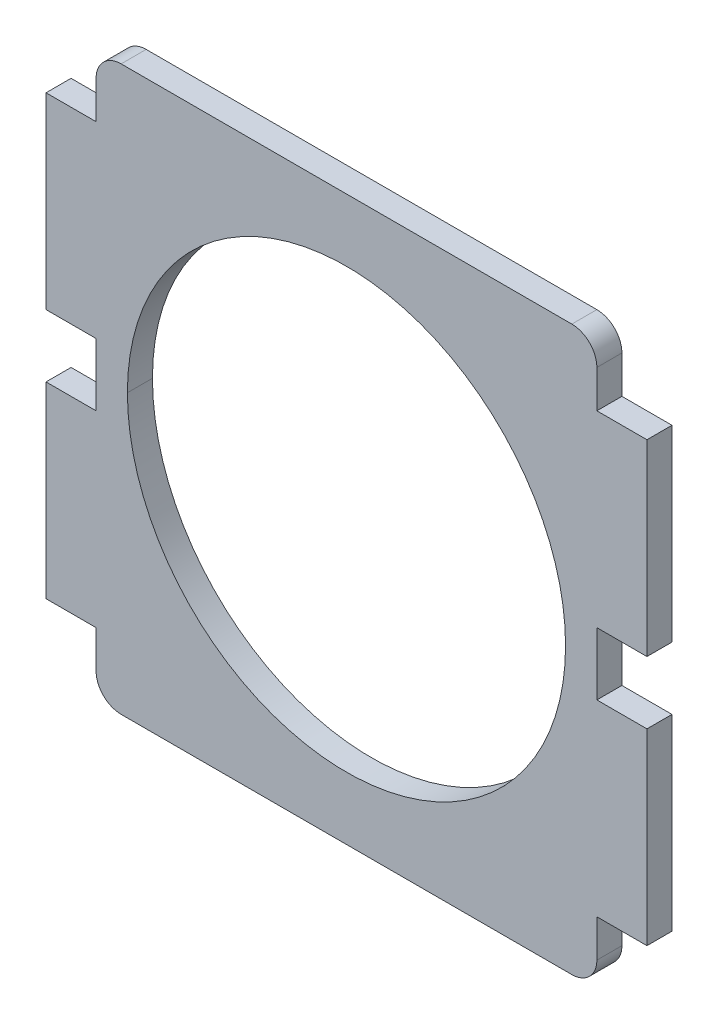
ISO-10303-21;
HEADER;
FILE_DESCRIPTION(('STEP AP214'),'2;1');
FILE_NAME('part.step','',(''),(''),'','','');
FILE_SCHEMA(('AUTOMOTIVE_DESIGN { 1 0 10303 214 1 1 1 1 }'));
ENDSEC;
DATA;
#1=APPLICATION_CONTEXT('core data for automotive mechanical design processes');
#2=APPLICATION_PROTOCOL_DEFINITION('international standard','automotive_design',2000,#1);
#3=PRODUCT_CONTEXT('',#1,'mechanical');
#4=PRODUCT('Part','Part','',(#3));
#5=PRODUCT_RELATED_PRODUCT_CATEGORY('part','',(#4));
#6=PRODUCT_DEFINITION_FORMATION('','',#4);
#7=PRODUCT_DEFINITION_CONTEXT('part definition',#1,'design');
#8=PRODUCT_DEFINITION('design','',#6,#7);
#9=PRODUCT_DEFINITION_SHAPE('','',#8);
#10=(LENGTH_UNIT() NAMED_UNIT(*) SI_UNIT(.MILLI.,.METRE.));
#11=(NAMED_UNIT(*) PLANE_ANGLE_UNIT() SI_UNIT($,.RADIAN.));
#12=(NAMED_UNIT(*) SI_UNIT($,.STERADIAN.) SOLID_ANGLE_UNIT());
#13=UNCERTAINTY_MEASURE_WITH_UNIT(LENGTH_MEASURE(1.E-05),#10,'distance_accuracy_value','');
#14=(GEOMETRIC_REPRESENTATION_CONTEXT(3) GLOBAL_UNCERTAINTY_ASSIGNED_CONTEXT((#13)) GLOBAL_UNIT_ASSIGNED_CONTEXT((#10,
#11,#12)) REPRESENTATION_CONTEXT('',''));
#15=CARTESIAN_POINT('',(0.,0.,0.));
#16=DIRECTION('',(0.,0.,1.));
#17=DIRECTION('',(1.,0.,0.));
#18=AXIS2_PLACEMENT_3D('',#15,#16,#17);
#19=CARTESIAN_POINT('',(0.,0.,0.));
#20=DIRECTION('',(0.,0.,1.));
#21=DIRECTION('',(1.,0.,0.));
#22=AXIS2_PLACEMENT_3D('',#19,#20,#21);
#23=CYLINDRICAL_SURFACE('',#22,17.5);
#24=DIRECTION('',(0.,0.,1.));
#25=VECTOR('',#24,1.);
#26=CARTESIAN_POINT('',(-17.5,0.,0.));
#27=LINE('',#26,#25);
#28=CARTESIAN_POINT('',(-17.5,0.,0.));
#29=VERTEX_POINT('',#28);
#30=CARTESIAN_POINT('',(-17.5,0.,2.));
#31=VERTEX_POINT('',#30);
#32=EDGE_CURVE('E349',#29,#31,#27,.T.);
#33=ORIENTED_EDGE('',*,*,#32,.F.);
#34=CARTESIAN_POINT('',(0.,0.,0.));
#35=DIRECTION('',(0.,0.,1.));
#36=DIRECTION('',(1.,0.,0.));
#37=AXIS2_PLACEMENT_3D('',#34,#35,#36);
#38=CIRCLE('',#37,17.5);
#39=CARTESIAN_POINT('',(17.5,0.,0.));
#40=VERTEX_POINT('',#39);
#41=EDGE_CURVE('E10',#40,#29,#38,.T.);
#42=ORIENTED_EDGE('',*,*,#41,.F.);
#43=DIRECTION('',(0.,0.,1.));
#44=VECTOR('',#43,1.);
#45=CARTESIAN_POINT('',(17.5,0.,0.));
#46=LINE('',#45,#44);
#47=CARTESIAN_POINT('',(17.5,0.,2.));
#48=VERTEX_POINT('',#47);
#49=EDGE_CURVE('E371',#40,#48,#46,.T.);
#50=ORIENTED_EDGE('',*,*,#49,.T.);
#51=CARTESIAN_POINT('',(0.,0.,2.));
#52=DIRECTION('',(0.,0.,1.));
#53=DIRECTION('',(1.,0.,0.));
#54=AXIS2_PLACEMENT_3D('',#51,#52,#53);
#55=CIRCLE('',#54,17.5);
#56=EDGE_CURVE('E288',#48,#31,#55,.T.);
#57=ORIENTED_EDGE('',*,*,#56,.T.);
#58=EDGE_LOOP('',(#33,#42,#50,#57));
#59=FACE_BOUND('',#58,.T.);
#60=ADVANCED_FACE('F16',(#59),#23,.F.);
#61=CARTESIAN_POINT('',(-18.,20.5,2.));
#62=DIRECTION('',(0.,0.,1.));
#63=DIRECTION('',(1.,0.,0.));
#64=AXIS2_PLACEMENT_3D('',#61,#62,#63);
#65=CYLINDRICAL_SURFACE('',#64,2.);
#66=CARTESIAN_POINT('',(-18.,20.5,2.));
#67=DIRECTION('',(0.,0.,1.));
#68=DIRECTION('',(1.,0.,0.));
#69=AXIS2_PLACEMENT_3D('',#66,#67,#68);
#70=CIRCLE('',#69,2.);
#71=CARTESIAN_POINT('',(-18.,22.5,2.));
#72=VERTEX_POINT('',#71);
#73=CARTESIAN_POINT('',(-20.,20.5,2.));
#74=VERTEX_POINT('',#73);
#75=EDGE_CURVE('E289',#72,#74,#70,.T.);
#76=ORIENTED_EDGE('',*,*,#75,.F.);
#77=DIRECTION('',(0.,0.,1.));
#78=VECTOR('',#77,1.);
#79=CARTESIAN_POINT('',(-18.,22.5,2.));
#80=LINE('',#79,#78);
#81=CARTESIAN_POINT('',(-18.,22.5,0.));
#82=VERTEX_POINT('',#81);
#83=EDGE_CURVE('E322',#82,#72,#80,.T.);
#84=ORIENTED_EDGE('',*,*,#83,.F.);
#85=CARTESIAN_POINT('',(-18.,20.5,0.));
#86=DIRECTION('',(0.,0.,-1.));
#87=DIRECTION('',(1.,0.,0.));
#88=AXIS2_PLACEMENT_3D('',#85,#86,#87);
#89=CIRCLE('',#88,2.);
#90=CARTESIAN_POINT('',(-20.,20.5,0.));
#91=VERTEX_POINT('',#90);
#92=EDGE_CURVE('E285',#91,#82,#89,.T.);
#93=ORIENTED_EDGE('',*,*,#92,.F.);
#94=DIRECTION('',(0.,0.,-1.));
#95=VECTOR('',#94,1.);
#96=CARTESIAN_POINT('',(-20.,20.5,0.));
#97=LINE('',#96,#95);
#98=EDGE_CURVE('E408',#74,#91,#97,.T.);
#99=ORIENTED_EDGE('',*,*,#98,.F.);
#100=EDGE_LOOP('',(#76,#84,#93,#99));
#101=FACE_BOUND('',#100,.T.);
#102=ADVANCED_FACE('F323',(#101),#65,.T.);
#103=CARTESIAN_POINT('',(18.,20.5,2.));
#104=DIRECTION('',(0.,0.,-1.));
#105=DIRECTION('',(-1.,0.,0.));
#106=AXIS2_PLACEMENT_3D('',#103,#104,#105);
#107=CYLINDRICAL_SURFACE('',#106,2.);
#108=CARTESIAN_POINT('',(18.,20.5,2.));
#109=DIRECTION('',(0.,0.,1.));
#110=DIRECTION('',(1.,0.,0.));
#111=AXIS2_PLACEMENT_3D('',#108,#109,#110);
#112=CIRCLE('',#111,2.);
#113=CARTESIAN_POINT('',(20.,20.5,2.));
#114=VERTEX_POINT('',#113);
#115=CARTESIAN_POINT('',(18.,22.5,2.));
#116=VERTEX_POINT('',#115);
#117=EDGE_CURVE('E299',#114,#116,#112,.T.);
#118=ORIENTED_EDGE('',*,*,#117,.F.);
#119=DIRECTION('',(0.,0.,1.));
#120=VECTOR('',#119,1.);
#121=CARTESIAN_POINT('',(20.,20.5,2.));
#122=LINE('',#121,#120);
#123=CARTESIAN_POINT('',(20.,20.5,0.));
#124=VERTEX_POINT('',#123);
#125=EDGE_CURVE('E379',#124,#114,#122,.T.);
#126=ORIENTED_EDGE('',*,*,#125,.F.);
#127=CARTESIAN_POINT('',(18.,20.5,0.));
#128=DIRECTION('',(0.,0.,-1.));
#129=DIRECTION('',(1.,0.,0.));
#130=AXIS2_PLACEMENT_3D('',#127,#128,#129);
#131=CIRCLE('',#130,2.);
#132=CARTESIAN_POINT('',(18.,22.5,0.));
#133=VERTEX_POINT('',#132);
#134=EDGE_CURVE('E25',#133,#124,#131,.T.);
#135=ORIENTED_EDGE('',*,*,#134,.F.);
#136=DIRECTION('',(0.,0.,-1.));
#137=VECTOR('',#136,1.);
#138=CARTESIAN_POINT('',(18.,22.5,2.));
#139=LINE('',#138,#137);
#140=EDGE_CURVE('E332',#116,#133,#139,.T.);
#141=ORIENTED_EDGE('',*,*,#140,.F.);
#142=EDGE_LOOP('',(#118,#126,#135,#141));
#143=FACE_BOUND('',#142,.T.);
#144=ADVANCED_FACE('F18',(#143),#107,.T.);
#145=CARTESIAN_POINT('',(-18.,-20.5,2.));
#146=DIRECTION('',(0.,0.,-1.));
#147=DIRECTION('',(-1.,0.,0.));
#148=AXIS2_PLACEMENT_3D('',#145,#146,#147);
#149=CYLINDRICAL_SURFACE('',#148,2.);
#150=CARTESIAN_POINT('',(-18.,-20.5,2.));
#151=DIRECTION('',(0.,0.,1.));
#152=DIRECTION('',(1.,0.,0.));
#153=AXIS2_PLACEMENT_3D('',#150,#151,#152);
#154=CIRCLE('',#153,2.);
#155=CARTESIAN_POINT('',(-20.,-20.5,2.));
#156=VERTEX_POINT('',#155);
#157=CARTESIAN_POINT('',(-18.,-22.5,2.));
#158=VERTEX_POINT('',#157);
#159=EDGE_CURVE('E286',#156,#158,#154,.T.);
#160=ORIENTED_EDGE('',*,*,#159,.F.);
#161=DIRECTION('',(0.,0.,1.));
#162=VECTOR('',#161,1.);
#163=CARTESIAN_POINT('',(-20.,-20.5,2.));
#164=LINE('',#163,#162);
#165=CARTESIAN_POINT('',(-20.,-20.5,0.));
#166=VERTEX_POINT('',#165);
#167=EDGE_CURVE('E416',#166,#156,#164,.T.);
#168=ORIENTED_EDGE('',*,*,#167,.F.);
#169=CARTESIAN_POINT('',(-18.,-20.5,0.));
#170=DIRECTION('',(0.,0.,-1.));
#171=DIRECTION('',(1.,0.,0.));
#172=AXIS2_PLACEMENT_3D('',#169,#170,#171);
#173=CIRCLE('',#172,2.);
#174=CARTESIAN_POINT('',(-18.,-22.5,0.));
#175=VERTEX_POINT('',#174);
#176=EDGE_CURVE('E305',#175,#166,#173,.T.);
#177=ORIENTED_EDGE('',*,*,#176,.F.);
#178=DIRECTION('',(0.,0.,-1.));
#179=VECTOR('',#178,1.);
#180=CARTESIAN_POINT('',(-18.,-22.5,2.));
#181=LINE('',#180,#179);
#182=EDGE_CURVE('E350',#158,#175,#181,.T.);
#183=ORIENTED_EDGE('',*,*,#182,.F.);
#184=EDGE_LOOP('',(#160,#168,#177,#183));
#185=FACE_BOUND('',#184,.T.);
#186=ADVANCED_FACE('F582',(#185),#149,.T.);
#187=CARTESIAN_POINT('',(18.,-20.5,2.));
#188=DIRECTION('',(0.,0.,1.));
#189=DIRECTION('',(1.,0.,0.));
#190=AXIS2_PLACEMENT_3D('',#187,#188,#189);
#191=CYLINDRICAL_SURFACE('',#190,2.);
#192=CARTESIAN_POINT('',(18.,-20.5,2.));
#193=DIRECTION('',(0.,0.,1.));
#194=DIRECTION('',(1.,0.,0.));
#195=AXIS2_PLACEMENT_3D('',#192,#193,#194);
#196=CIRCLE('',#195,2.);
#197=CARTESIAN_POINT('',(18.,-22.5,2.));
#198=VERTEX_POINT('',#197);
#199=CARTESIAN_POINT('',(20.,-20.5,2.));
#200=VERTEX_POINT('',#199);
#201=EDGE_CURVE('E443',#198,#200,#196,.T.);
#202=ORIENTED_EDGE('',*,*,#201,.F.);
#203=DIRECTION('',(0.,0.,1.));
#204=VECTOR('',#203,1.);
#205=CARTESIAN_POINT('',(18.,-22.5,2.));
#206=LINE('',#205,#204);
#207=CARTESIAN_POINT('',(18.,-22.5,0.));
#208=VERTEX_POINT('',#207);
#209=EDGE_CURVE('E435',#208,#198,#206,.T.);
#210=ORIENTED_EDGE('',*,*,#209,.F.);
#211=CARTESIAN_POINT('',(18.,-20.5,0.));
#212=DIRECTION('',(0.,0.,-1.));
#213=DIRECTION('',(1.,0.,0.));
#214=AXIS2_PLACEMENT_3D('',#211,#212,#213);
#215=CIRCLE('',#214,2.);
#216=CARTESIAN_POINT('',(20.,-20.5,0.));
#217=VERTEX_POINT('',#216);
#218=EDGE_CURVE('E302',#217,#208,#215,.T.);
#219=ORIENTED_EDGE('',*,*,#218,.F.);
#220=DIRECTION('',(0.,0.,-1.));
#221=VECTOR('',#220,1.);
#222=CARTESIAN_POINT('',(20.,-20.5,0.));
#223=LINE('',#222,#221);
#224=EDGE_CURVE('E378',#200,#217,#223,.T.);
#225=ORIENTED_EDGE('',*,*,#224,.F.);
#226=EDGE_LOOP('',(#202,#210,#219,#225));
#227=FACE_BOUND('',#226,.T.);
#228=ADVANCED_FACE('F573',(#227),#191,.T.);
#229=CARTESIAN_POINT('',(0.,0.,0.));
#230=DIRECTION('',(0.,0.,1.));
#231=DIRECTION('',(1.,0.,0.));
#232=AXIS2_PLACEMENT_3D('',#229,#230,#231);
#233=PLANE('',#232);
#234=ORIENTED_EDGE('',*,*,#41,.T.);
#235=CARTESIAN_POINT('',(0.,0.,0.));
#236=DIRECTION('',(0.,0.,1.));
#237=DIRECTION('',(1.,0.,0.));
#238=AXIS2_PLACEMENT_3D('',#235,#236,#237);
#239=CIRCLE('',#238,17.5);
#240=EDGE_CURVE('E345',#29,#40,#239,.T.);
#241=ORIENTED_EDGE('',*,*,#240,.T.);
#242=EDGE_LOOP('',(#234,#241));
#243=FACE_BOUND('',#242,.T.);
#244=DIRECTION('',(0.,-1.,0.));
#245=VECTOR('',#244,1.);
#246=CARTESIAN_POINT('',(20.,0.,0.));
#247=LINE('',#246,#245);
#248=CARTESIAN_POINT('',(20.,-17.5,0.));
#249=VERTEX_POINT('',#248);
#250=EDGE_CURVE('E487',#249,#217,#247,.T.);
#251=ORIENTED_EDGE('',*,*,#250,.T.);
#252=ORIENTED_EDGE('',*,*,#218,.T.);
#253=DIRECTION('',(1.,0.,0.));
#254=VECTOR('',#253,1.);
#255=CARTESIAN_POINT('',(0.,-22.5,0.));
#256=LINE('',#255,#254);
#257=EDGE_CURVE('E505',#175,#208,#256,.T.);
#258=ORIENTED_EDGE('',*,*,#257,.F.);
#259=ORIENTED_EDGE('',*,*,#176,.T.);
#260=DIRECTION('',(0.,-1.,0.));
#261=VECTOR('',#260,1.);
#262=CARTESIAN_POINT('',(-20.,0.,0.));
#263=LINE('',#262,#261);
#264=CARTESIAN_POINT('',(-20.,-17.5,0.));
#265=VERTEX_POINT('',#264);
#266=EDGE_CURVE('E421',#265,#166,#263,.T.);
#267=ORIENTED_EDGE('',*,*,#266,.F.);
#268=DIRECTION('',(1.,0.,0.));
#269=VECTOR('',#268,1.);
#270=CARTESIAN_POINT('',(0.,-17.5,0.));
#271=LINE('',#270,#269);
#272=CARTESIAN_POINT('',(-24.,-17.5,0.));
#273=VERTEX_POINT('',#272);
#274=EDGE_CURVE('E481',#273,#265,#271,.T.);
#275=ORIENTED_EDGE('',*,*,#274,.F.);
#276=DIRECTION('',(0.,-1.,0.));
#277=VECTOR('',#276,1.);
#278=CARTESIAN_POINT('',(-24.,0.,0.));
#279=LINE('',#278,#277);
#280=CARTESIAN_POINT('',(-24.,-2.49999999999996,0.));
#281=VERTEX_POINT('',#280);
#282=EDGE_CURVE('E397',#281,#273,#279,.T.);
#283=ORIENTED_EDGE('',*,*,#282,.F.);
#284=DIRECTION('',(-1.,0.,0.));
#285=VECTOR('',#284,1.);
#286=CARTESIAN_POINT('',(0.,-2.49999999999997,0.));
#287=LINE('',#286,#285);
#288=CARTESIAN_POINT('',(-20.,-2.49999999999996,0.));
#289=VERTEX_POINT('',#288);
#290=EDGE_CURVE('E356',#289,#281,#287,.T.);
#291=ORIENTED_EDGE('',*,*,#290,.F.);
#292=DIRECTION('',(0.,-1.,0.));
#293=VECTOR('',#292,1.);
#294=CARTESIAN_POINT('',(-20.,0.,0.));
#295=LINE('',#294,#293);
#296=CARTESIAN_POINT('',(-20.,2.5,0.));
#297=VERTEX_POINT('',#296);
#298=EDGE_CURVE('E453',#297,#289,#295,.T.);
#299=ORIENTED_EDGE('',*,*,#298,.F.);
#300=DIRECTION('',(-1.,0.,0.));
#301=VECTOR('',#300,1.);
#302=CARTESIAN_POINT('',(0.,2.5,0.));
#303=LINE('',#302,#301);
#304=CARTESIAN_POINT('',(-24.,2.5,0.));
#305=VERTEX_POINT('',#304);
#306=EDGE_CURVE('E440',#297,#305,#303,.T.);
#307=ORIENTED_EDGE('',*,*,#306,.T.);
#308=DIRECTION('',(0.,1.,0.));
#309=VECTOR('',#308,1.);
#310=CARTESIAN_POINT('',(-24.,0.,0.));
#311=LINE('',#310,#309);
#312=CARTESIAN_POINT('',(-24.,17.5,0.));
#313=VERTEX_POINT('',#312);
#314=EDGE_CURVE('E393',#305,#313,#311,.T.);
#315=ORIENTED_EDGE('',*,*,#314,.T.);
#316=DIRECTION('',(1.,0.,0.));
#317=VECTOR('',#316,1.);
#318=CARTESIAN_POINT('',(0.,17.5,0.));
#319=LINE('',#318,#317);
#320=CARTESIAN_POINT('',(-20.,17.5,0.));
#321=VERTEX_POINT('',#320);
#322=EDGE_CURVE('E422',#313,#321,#319,.T.);
#323=ORIENTED_EDGE('',*,*,#322,.T.);
#324=DIRECTION('',(0.,-1.,0.));
#325=VECTOR('',#324,1.);
#326=CARTESIAN_POINT('',(-20.,0.,0.));
#327=LINE('',#326,#325);
#328=EDGE_CURVE('E317',#91,#321,#327,.T.);
#329=ORIENTED_EDGE('',*,*,#328,.F.);
#330=ORIENTED_EDGE('',*,*,#92,.T.);
#331=DIRECTION('',(1.,0.,0.));
#332=VECTOR('',#331,1.);
#333=CARTESIAN_POINT('',(0.,22.5,0.));
#334=LINE('',#333,#332);
#335=EDGE_CURVE('E314',#82,#133,#334,.T.);
#336=ORIENTED_EDGE('',*,*,#335,.T.);
#337=ORIENTED_EDGE('',*,*,#134,.T.);
#338=DIRECTION('',(0.,-1.,0.));
#339=VECTOR('',#338,1.);
#340=CARTESIAN_POINT('',(20.,0.,0.));
#341=LINE('',#340,#339);
#342=CARTESIAN_POINT('',(20.,17.5,0.));
#343=VERTEX_POINT('',#342);
#344=EDGE_CURVE('E384',#124,#343,#341,.T.);
#345=ORIENTED_EDGE('',*,*,#344,.T.);
#346=DIRECTION('',(-1.,0.,0.));
#347=VECTOR('',#346,1.);
#348=CARTESIAN_POINT('',(0.,17.5,0.));
#349=LINE('',#348,#347);
#350=CARTESIAN_POINT('',(24.,17.5,0.));
#351=VERTEX_POINT('',#350);
#352=EDGE_CURVE('E52',#351,#343,#349,.T.);
#353=ORIENTED_EDGE('',*,*,#352,.F.);
#354=DIRECTION('',(0.,1.,0.));
#355=VECTOR('',#354,1.);
#356=CARTESIAN_POINT('',(24.,0.,0.));
#357=LINE('',#356,#355);
#358=CARTESIAN_POINT('',(24.,2.5,0.));
#359=VERTEX_POINT('',#358);
#360=EDGE_CURVE('E246',#359,#351,#357,.T.);
#361=ORIENTED_EDGE('',*,*,#360,.F.);
#362=DIRECTION('',(1.,0.,0.));
#363=VECTOR('',#362,1.);
#364=CARTESIAN_POINT('',(0.,2.5,0.));
#365=LINE('',#364,#363);
#366=CARTESIAN_POINT('',(20.,2.5,0.));
#367=VERTEX_POINT('',#366);
#368=EDGE_CURVE('E251',#367,#359,#365,.T.);
#369=ORIENTED_EDGE('',*,*,#368,.F.);
#370=DIRECTION('',(0.,-1.,0.));
#371=VECTOR('',#370,1.);
#372=CARTESIAN_POINT('',(20.,0.,0.));
#373=LINE('',#372,#371);
#374=CARTESIAN_POINT('',(20.,-2.49999999999996,0.));
#375=VERTEX_POINT('',#374);
#376=EDGE_CURVE('E282',#367,#375,#373,.T.);
#377=ORIENTED_EDGE('',*,*,#376,.T.);
#378=DIRECTION('',(1.,0.,0.));
#379=VECTOR('',#378,1.);
#380=CARTESIAN_POINT('',(0.,-2.49999999999997,0.));
#381=LINE('',#380,#379);
#382=CARTESIAN_POINT('',(24.,-2.49999999999996,0.));
#383=VERTEX_POINT('',#382);
#384=EDGE_CURVE('E536',#375,#383,#381,.T.);
#385=ORIENTED_EDGE('',*,*,#384,.T.);
#386=DIRECTION('',(0.,-1.,0.));
#387=VECTOR('',#386,1.);
#388=CARTESIAN_POINT('',(24.,0.,0.));
#389=LINE('',#388,#387);
#390=CARTESIAN_POINT('',(24.,-17.5,0.));
#391=VERTEX_POINT('',#390);
#392=EDGE_CURVE('E526',#383,#391,#389,.T.);
#393=ORIENTED_EDGE('',*,*,#392,.T.);
#394=DIRECTION('',(-1.,0.,0.));
#395=VECTOR('',#394,1.);
#396=CARTESIAN_POINT('',(0.,-17.5,0.));
#397=LINE('',#396,#395);
#398=EDGE_CURVE('E486',#391,#249,#397,.T.);
#399=ORIENTED_EDGE('',*,*,#398,.T.);
#400=EDGE_LOOP('',(#251,#252,#258,#259,#267,#275,#283,#291,#299,#307,#315,#323,#329,#330,#336,
#337,#345,#353,#361,#369,#377,#385,#393,#399));
#401=FACE_BOUND('',#400,.T.);
#402=ADVANCED_FACE('F249',(#243,#401),#233,.F.);
#403=CARTESIAN_POINT('',(0.,0.,2.));
#404=DIRECTION('',(0.,0.,1.));
#405=DIRECTION('',(1.,0.,0.));
#406=AXIS2_PLACEMENT_3D('',#403,#404,#405);
#407=PLANE('',#406);
#408=ORIENTED_EDGE('',*,*,#56,.F.);
#409=CARTESIAN_POINT('',(0.,0.,2.));
#410=DIRECTION('',(0.,0.,1.));
#411=DIRECTION('',(1.,0.,0.));
#412=AXIS2_PLACEMENT_3D('',#409,#410,#411);
#413=CIRCLE('',#412,17.5);
#414=EDGE_CURVE('E365',#31,#48,#413,.T.);
#415=ORIENTED_EDGE('',*,*,#414,.F.);
#416=EDGE_LOOP('',(#408,#415));
#417=FACE_BOUND('',#416,.T.);
#418=DIRECTION('',(1.,0.,0.));
#419=VECTOR('',#418,1.);
#420=CARTESIAN_POINT('',(0.,-22.5,2.));
#421=LINE('',#420,#419);
#422=EDGE_CURVE('E355',#158,#198,#421,.T.);
#423=ORIENTED_EDGE('',*,*,#422,.T.);
#424=ORIENTED_EDGE('',*,*,#201,.T.);
#425=DIRECTION('',(0.,-1.,0.));
#426=VECTOR('',#425,1.);
#427=CARTESIAN_POINT('',(20.,0.,2.));
#428=LINE('',#427,#426);
#429=CARTESIAN_POINT('',(20.,-17.5,2.));
#430=VERTEX_POINT('',#429);
#431=EDGE_CURVE('E354',#430,#200,#428,.T.);
#432=ORIENTED_EDGE('',*,*,#431,.F.);
#433=DIRECTION('',(-1.,0.,0.));
#434=VECTOR('',#433,1.);
#435=CARTESIAN_POINT('',(0.,-17.5,2.));
#436=LINE('',#435,#434);
#437=CARTESIAN_POINT('',(24.,-17.5,2.));
#438=VERTEX_POINT('',#437);
#439=EDGE_CURVE('E525',#438,#430,#436,.T.);
#440=ORIENTED_EDGE('',*,*,#439,.F.);
#441=DIRECTION('',(0.,-1.,0.));
#442=VECTOR('',#441,1.);
#443=CARTESIAN_POINT('',(24.,0.,2.));
#444=LINE('',#443,#442);
#445=CARTESIAN_POINT('',(24.,-2.49999999999996,2.));
#446=VERTEX_POINT('',#445);
#447=EDGE_CURVE('E533',#446,#438,#444,.T.);
#448=ORIENTED_EDGE('',*,*,#447,.F.);
#449=DIRECTION('',(1.,0.,0.));
#450=VECTOR('',#449,1.);
#451=CARTESIAN_POINT('',(0.,-2.49999999999997,2.));
#452=LINE('',#451,#450);
#453=CARTESIAN_POINT('',(20.,-2.49999999999996,2.));
#454=VERTEX_POINT('',#453);
#455=EDGE_CURVE('E542',#454,#446,#452,.T.);
#456=ORIENTED_EDGE('',*,*,#455,.F.);
#457=DIRECTION('',(0.,-1.,0.));
#458=VECTOR('',#457,1.);
#459=CARTESIAN_POINT('',(20.,0.,2.));
#460=LINE('',#459,#458);
#461=CARTESIAN_POINT('',(20.,2.5,2.));
#462=VERTEX_POINT('',#461);
#463=EDGE_CURVE('E272',#462,#454,#460,.T.);
#464=ORIENTED_EDGE('',*,*,#463,.F.);
#465=DIRECTION('',(1.,0.,0.));
#466=VECTOR('',#465,1.);
#467=CARTESIAN_POINT('',(0.,2.5,2.));
#468=LINE('',#467,#466);
#469=CARTESIAN_POINT('',(24.,2.5,2.));
#470=VERTEX_POINT('',#469);
#471=EDGE_CURVE('E257',#462,#470,#468,.T.);
#472=ORIENTED_EDGE('',*,*,#471,.T.);
#473=DIRECTION('',(0.,1.,0.));
#474=VECTOR('',#473,1.);
#475=CARTESIAN_POINT('',(24.,0.,2.));
#476=LINE('',#475,#474);
#477=CARTESIAN_POINT('',(24.,17.5,2.));
#478=VERTEX_POINT('',#477);
#479=EDGE_CURVE('E262',#470,#478,#476,.T.);
#480=ORIENTED_EDGE('',*,*,#479,.T.);
#481=DIRECTION('',(-1.,0.,0.));
#482=VECTOR('',#481,1.);
#483=CARTESIAN_POINT('',(0.,17.5,2.));
#484=LINE('',#483,#482);
#485=CARTESIAN_POINT('',(20.,17.5,2.));
#486=VERTEX_POINT('',#485);
#487=EDGE_CURVE('E38',#478,#486,#484,.T.);
#488=ORIENTED_EDGE('',*,*,#487,.T.);
#489=DIRECTION('',(0.,-1.,0.));
#490=VECTOR('',#489,1.);
#491=CARTESIAN_POINT('',(20.,0.,2.));
#492=LINE('',#491,#490);
#493=EDGE_CURVE('E383',#114,#486,#492,.T.);
#494=ORIENTED_EDGE('',*,*,#493,.F.);
#495=ORIENTED_EDGE('',*,*,#117,.T.);
#496=DIRECTION('',(1.,0.,0.));
#497=VECTOR('',#496,1.);
#498=CARTESIAN_POINT('',(0.,22.5,2.));
#499=LINE('',#498,#497);
#500=EDGE_CURVE('E339',#72,#116,#499,.T.);
#501=ORIENTED_EDGE('',*,*,#500,.F.);
#502=ORIENTED_EDGE('',*,*,#75,.T.);
#503=DIRECTION('',(0.,-1.,0.));
#504=VECTOR('',#503,1.);
#505=CARTESIAN_POINT('',(-20.,0.,2.));
#506=LINE('',#505,#504);
#507=CARTESIAN_POINT('',(-20.,17.5,2.));
#508=VERTEX_POINT('',#507);
#509=EDGE_CURVE('E328',#74,#508,#506,.T.);
#510=ORIENTED_EDGE('',*,*,#509,.T.);
#511=DIRECTION('',(1.,0.,0.));
#512=VECTOR('',#511,1.);
#513=CARTESIAN_POINT('',(0.,17.5,2.));
#514=LINE('',#513,#512);
#515=CARTESIAN_POINT('',(-24.,17.5,2.));
#516=VERTEX_POINT('',#515);
#517=EDGE_CURVE('E429',#516,#508,#514,.T.);
#518=ORIENTED_EDGE('',*,*,#517,.F.);
#519=DIRECTION('',(0.,1.,0.));
#520=VECTOR('',#519,1.);
#521=CARTESIAN_POINT('',(-24.,0.,2.));
#522=LINE('',#521,#520);
#523=CARTESIAN_POINT('',(-24.,2.5,2.));
#524=VERTEX_POINT('',#523);
#525=EDGE_CURVE('E392',#524,#516,#522,.T.);
#526=ORIENTED_EDGE('',*,*,#525,.F.);
#527=DIRECTION('',(-1.,0.,0.));
#528=VECTOR('',#527,1.);
#529=CARTESIAN_POINT('',(0.,2.5,2.));
#530=LINE('',#529,#528);
#531=CARTESIAN_POINT('',(-20.,2.5,2.));
#532=VERTEX_POINT('',#531);
#533=EDGE_CURVE('E450',#532,#524,#530,.T.);
#534=ORIENTED_EDGE('',*,*,#533,.F.);
#535=DIRECTION('',(0.,-1.,0.));
#536=VECTOR('',#535,1.);
#537=CARTESIAN_POINT('',(-20.,0.,2.));
#538=LINE('',#537,#536);
#539=CARTESIAN_POINT('',(-20.,-2.49999999999996,2.));
#540=VERTEX_POINT('',#539);
#541=EDGE_CURVE('E361',#532,#540,#538,.T.);
#542=ORIENTED_EDGE('',*,*,#541,.T.);
#543=DIRECTION('',(-1.,0.,0.));
#544=VECTOR('',#543,1.);
#545=CARTESIAN_POINT('',(0.,-2.49999999999997,2.));
#546=LINE('',#545,#544);
#547=CARTESIAN_POINT('',(-24.,-2.49999999999996,2.));
#548=VERTEX_POINT('',#547);
#549=EDGE_CURVE('E402',#540,#548,#546,.T.);
#550=ORIENTED_EDGE('',*,*,#549,.T.);
#551=DIRECTION('',(0.,-1.,0.));
#552=VECTOR('',#551,1.);
#553=CARTESIAN_POINT('',(-24.,0.,2.));
#554=LINE('',#553,#552);
#555=CARTESIAN_POINT('',(-24.,-17.5,2.));
#556=VERTEX_POINT('',#555);
#557=EDGE_CURVE('E477',#548,#556,#554,.T.);
#558=ORIENTED_EDGE('',*,*,#557,.T.);
#559=DIRECTION('',(1.,0.,0.));
#560=VECTOR('',#559,1.);
#561=CARTESIAN_POINT('',(0.,-17.5,2.));
#562=LINE('',#561,#560);
#563=CARTESIAN_POINT('',(-20.,-17.5,2.));
#564=VERTEX_POINT('',#563);
#565=EDGE_CURVE('E491',#556,#564,#562,.T.);
#566=ORIENTED_EDGE('',*,*,#565,.T.);
#567=DIRECTION('',(0.,-1.,0.));
#568=VECTOR('',#567,1.);
#569=CARTESIAN_POINT('',(-20.,0.,2.));
#570=LINE('',#569,#568);
#571=EDGE_CURVE('E420',#564,#156,#570,.T.);
#572=ORIENTED_EDGE('',*,*,#571,.T.);
#573=ORIENTED_EDGE('',*,*,#159,.T.);
#574=EDGE_LOOP('',(#423,#424,#432,#440,#448,#456,#464,#472,#480,#488,#494,#495,#501,#502,#510,
#518,#526,#534,#542,#550,#558,#566,#572,#573));
#575=FACE_BOUND('',#574,.T.);
#576=ADVANCED_FACE('F618',(#417,#575),#407,.T.);
#577=CARTESIAN_POINT('',(0.,17.5,2.));
#578=DIRECTION('',(0.,-1.,0.));
#579=DIRECTION('',(0.,0.,-1.));
#580=AXIS2_PLACEMENT_3D('',#577,#578,#579);
#581=PLANE('',#580);
#582=ORIENTED_EDGE('',*,*,#352,.T.);
#583=DIRECTION('',(0.,0.,-1.));
#584=VECTOR('',#583,1.);
#585=CARTESIAN_POINT('',(20.,17.5,2.));
#586=LINE('',#585,#584);
#587=EDGE_CURVE('E368',#486,#343,#586,.T.);
#588=ORIENTED_EDGE('',*,*,#587,.F.);
#589=ORIENTED_EDGE('',*,*,#487,.F.);
#590=DIRECTION('',(0.,0.,-1.));
#591=VECTOR('',#590,1.);
#592=CARTESIAN_POINT('',(24.,17.5,2.));
#593=LINE('',#592,#591);
#594=EDGE_CURVE('E256',#478,#351,#593,.T.);
#595=ORIENTED_EDGE('',*,*,#594,.T.);
#596=EDGE_LOOP('',(#582,#588,#589,#595));
#597=FACE_BOUND('',#596,.T.);
#598=ADVANCED_FACE('F625',(#597),#581,.F.);
#599=CARTESIAN_POINT('',(24.,0.,2.));
#600=DIRECTION('',(-1.,0.,0.));
#601=DIRECTION('',(0.,0.,1.));
#602=AXIS2_PLACEMENT_3D('',#599,#600,#601);
#603=PLANE('',#602);
#604=ORIENTED_EDGE('',*,*,#360,.T.);
#605=ORIENTED_EDGE('',*,*,#594,.F.);
#606=ORIENTED_EDGE('',*,*,#479,.F.);
#607=DIRECTION('',(0.,0.,-1.));
#608=VECTOR('',#607,1.);
#609=CARTESIAN_POINT('',(24.,2.5,2.));
#610=LINE('',#609,#608);
#611=EDGE_CURVE('E260',#470,#359,#610,.T.);
#612=ORIENTED_EDGE('',*,*,#611,.T.);
#613=EDGE_LOOP('',(#604,#605,#606,#612));
#614=FACE_BOUND('',#613,.T.);
#615=ADVANCED_FACE('F261',(#614),#603,.F.);
#616=CARTESIAN_POINT('',(0.,2.5,2.));
#617=DIRECTION('',(0.,1.,0.));
#618=DIRECTION('',(1.,0.,0.));
#619=AXIS2_PLACEMENT_3D('',#616,#617,#618);
#620=PLANE('',#619);
#621=ORIENTED_EDGE('',*,*,#368,.T.);
#622=ORIENTED_EDGE('',*,*,#611,.F.);
#623=ORIENTED_EDGE('',*,*,#471,.F.);
#624=DIRECTION('',(0.,0.,-1.));
#625=VECTOR('',#624,1.);
#626=CARTESIAN_POINT('',(20.,2.5,2.));
#627=LINE('',#626,#625);
#628=EDGE_CURVE('E269',#462,#367,#627,.T.);
#629=ORIENTED_EDGE('',*,*,#628,.T.);
#630=EDGE_LOOP('',(#621,#622,#623,#629));
#631=FACE_BOUND('',#630,.T.);
#632=ADVANCED_FACE('F267',(#631),#620,.F.);
#633=CARTESIAN_POINT('',(20.,0.,2.));
#634=DIRECTION('',(1.,0.,0.));
#635=DIRECTION('',(0.,1.,0.));
#636=AXIS2_PLACEMENT_3D('',#633,#634,#635);
#637=PLANE('',#636);
#638=ORIENTED_EDGE('',*,*,#376,.F.);
#639=ORIENTED_EDGE('',*,*,#628,.F.);
#640=ORIENTED_EDGE('',*,*,#463,.T.);
#641=DIRECTION('',(0.,0.,-1.));
#642=VECTOR('',#641,1.);
#643=CARTESIAN_POINT('',(20.,-2.49999999999996,2.));
#644=LINE('',#643,#642);
#645=EDGE_CURVE('E539',#454,#375,#644,.T.);
#646=ORIENTED_EDGE('',*,*,#645,.T.);
#647=EDGE_LOOP('',(#638,#639,#640,#646));
#648=FACE_BOUND('',#647,.T.);
#649=ADVANCED_FACE('F554',(#648),#637,.T.);
#650=CARTESIAN_POINT('',(0.,-2.49999999999997,2.));
#651=DIRECTION('',(0.,1.,0.));
#652=DIRECTION('',(1.,0.,0.));
#653=AXIS2_PLACEMENT_3D('',#650,#651,#652);
#654=PLANE('',#653);
#655=ORIENTED_EDGE('',*,*,#384,.F.);
#656=ORIENTED_EDGE('',*,*,#645,.F.);
#657=ORIENTED_EDGE('',*,*,#455,.T.);
#658=DIRECTION('',(0.,0.,-1.));
#659=VECTOR('',#658,1.);
#660=CARTESIAN_POINT('',(24.,-2.49999999999996,2.));
#661=LINE('',#660,#659);
#662=EDGE_CURVE('E529',#446,#383,#661,.T.);
#663=ORIENTED_EDGE('',*,*,#662,.T.);
#664=EDGE_LOOP('',(#655,#656,#657,#663));
#665=FACE_BOUND('',#664,.T.);
#666=ADVANCED_FACE('F556',(#665),#654,.T.);
#667=CARTESIAN_POINT('',(24.,0.,2.));
#668=DIRECTION('',(1.,0.,0.));
#669=DIRECTION('',(0.,1.,0.));
#670=AXIS2_PLACEMENT_3D('',#667,#668,#669);
#671=PLANE('',#670);
#672=ORIENTED_EDGE('',*,*,#392,.F.);
#673=ORIENTED_EDGE('',*,*,#662,.F.);
#674=ORIENTED_EDGE('',*,*,#447,.T.);
#675=DIRECTION('',(0.,0.,-1.));
#676=VECTOR('',#675,1.);
#677=CARTESIAN_POINT('',(24.,-17.5,2.));
#678=LINE('',#677,#676);
#679=EDGE_CURVE('E521',#438,#391,#678,.T.);
#680=ORIENTED_EDGE('',*,*,#679,.T.);
#681=EDGE_LOOP('',(#672,#673,#674,#680));
#682=FACE_BOUND('',#681,.T.);
#683=ADVANCED_FACE('F560',(#682),#671,.T.);
#684=CARTESIAN_POINT('',(0.,-17.5,2.));
#685=DIRECTION('',(0.,-1.,0.));
#686=DIRECTION('',(0.,0.,-1.));
#687=AXIS2_PLACEMENT_3D('',#684,#685,#686);
#688=PLANE('',#687);
#689=ORIENTED_EDGE('',*,*,#398,.F.);
#690=ORIENTED_EDGE('',*,*,#679,.F.);
#691=ORIENTED_EDGE('',*,*,#439,.T.);
#692=DIRECTION('',(0.,0.,-1.));
#693=VECTOR('',#692,1.);
#694=CARTESIAN_POINT('',(20.,-17.5,2.));
#695=LINE('',#694,#693);
#696=EDGE_CURVE('E482',#430,#249,#695,.T.);
#697=ORIENTED_EDGE('',*,*,#696,.T.);
#698=EDGE_LOOP('',(#689,#690,#691,#697));
#699=FACE_BOUND('',#698,.T.);
#700=ADVANCED_FACE('F566',(#699),#688,.T.);
#701=CARTESIAN_POINT('',(20.,0.,2.));
#702=DIRECTION('',(1.,0.,0.));
#703=DIRECTION('',(0.,1.,0.));
#704=AXIS2_PLACEMENT_3D('',#701,#702,#703);
#705=PLANE('',#704);
#706=ORIENTED_EDGE('',*,*,#431,.T.);
#707=ORIENTED_EDGE('',*,*,#224,.T.);
#708=ORIENTED_EDGE('',*,*,#250,.F.);
#709=ORIENTED_EDGE('',*,*,#696,.F.);
#710=EDGE_LOOP('',(#706,#707,#708,#709));
#711=FACE_BOUND('',#710,.T.);
#712=ADVANCED_FACE('F570',(#711),#705,.T.);
#713=CARTESIAN_POINT('',(0.,-22.5,2.));
#714=DIRECTION('',(0.,1.,0.));
#715=DIRECTION('',(1.,0.,0.));
#716=AXIS2_PLACEMENT_3D('',#713,#714,#715);
#717=PLANE('',#716);
#718=ORIENTED_EDGE('',*,*,#257,.T.);
#719=ORIENTED_EDGE('',*,*,#209,.T.);
#720=ORIENTED_EDGE('',*,*,#422,.F.);
#721=ORIENTED_EDGE('',*,*,#182,.T.);
#722=EDGE_LOOP('',(#718,#719,#720,#721));
#723=FACE_BOUND('',#722,.T.);
#724=ADVANCED_FACE('F578',(#723),#717,.F.);
#725=CARTESIAN_POINT('',(-20.,0.,2.));
#726=DIRECTION('',(1.,0.,0.));
#727=DIRECTION('',(0.,1.,0.));
#728=AXIS2_PLACEMENT_3D('',#725,#726,#727);
#729=PLANE('',#728);
#730=ORIENTED_EDGE('',*,*,#266,.T.);
#731=ORIENTED_EDGE('',*,*,#167,.T.);
#732=ORIENTED_EDGE('',*,*,#571,.F.);
#733=DIRECTION('',(0.,0.,-1.));
#734=VECTOR('',#733,1.);
#735=CARTESIAN_POINT('',(-20.,-17.5,2.));
#736=LINE('',#735,#734);
#737=EDGE_CURVE('E495',#564,#265,#736,.T.);
#738=ORIENTED_EDGE('',*,*,#737,.T.);
#739=EDGE_LOOP('',(#730,#731,#732,#738));
#740=FACE_BOUND('',#739,.T.);
#741=ADVANCED_FACE('F584',(#740),#729,.F.);
#742=CARTESIAN_POINT('',(0.,-17.5,2.));
#743=DIRECTION('',(0.,1.,0.));
#744=DIRECTION('',(1.,0.,0.));
#745=AXIS2_PLACEMENT_3D('',#742,#743,#744);
#746=PLANE('',#745);
#747=ORIENTED_EDGE('',*,*,#274,.T.);
#748=ORIENTED_EDGE('',*,*,#737,.F.);
#749=ORIENTED_EDGE('',*,*,#565,.F.);
#750=DIRECTION('',(0.,0.,-1.));
#751=VECTOR('',#750,1.);
#752=CARTESIAN_POINT('',(-24.,-17.5,2.));
#753=LINE('',#752,#751);
#754=EDGE_CURVE('E401',#556,#273,#753,.T.);
#755=ORIENTED_EDGE('',*,*,#754,.T.);
#756=EDGE_LOOP('',(#747,#748,#749,#755));
#757=FACE_BOUND('',#756,.T.);
#758=ADVANCED_FACE('F588',(#757),#746,.F.);
#759=CARTESIAN_POINT('',(-24.,0.,2.));
#760=DIRECTION('',(1.,0.,0.));
#761=DIRECTION('',(0.,-1.,0.));
#762=AXIS2_PLACEMENT_3D('',#759,#760,#761);
#763=PLANE('',#762);
#764=ORIENTED_EDGE('',*,*,#282,.T.);
#765=ORIENTED_EDGE('',*,*,#754,.F.);
#766=ORIENTED_EDGE('',*,*,#557,.F.);
#767=DIRECTION('',(0.,0.,-1.));
#768=VECTOR('',#767,1.);
#769=CARTESIAN_POINT('',(-24.,-2.49999999999996,2.));
#770=LINE('',#769,#768);
#771=EDGE_CURVE('E360',#548,#281,#770,.T.);
#772=ORIENTED_EDGE('',*,*,#771,.T.);
#773=EDGE_LOOP('',(#764,#765,#766,#772));
#774=FACE_BOUND('',#773,.T.);
#775=ADVANCED_FACE('F590',(#774),#763,.F.);
#776=CARTESIAN_POINT('',(0.,-2.49999999999997,2.));
#777=DIRECTION('',(0.,-1.,0.));
#778=DIRECTION('',(-1.,0.,0.));
#779=AXIS2_PLACEMENT_3D('',#776,#777,#778);
#780=PLANE('',#779);
#781=ORIENTED_EDGE('',*,*,#290,.T.);
#782=ORIENTED_EDGE('',*,*,#771,.F.);
#783=ORIENTED_EDGE('',*,*,#549,.F.);
#784=DIRECTION('',(0.,0.,-1.));
#785=VECTOR('',#784,1.);
#786=CARTESIAN_POINT('',(-20.,-2.49999999999996,2.));
#787=LINE('',#786,#785);
#788=EDGE_CURVE('E461',#540,#289,#787,.T.);
#789=ORIENTED_EDGE('',*,*,#788,.T.);
#790=EDGE_LOOP('',(#781,#782,#783,#789));
#791=FACE_BOUND('',#790,.T.);
#792=ADVANCED_FACE('F593',(#791),#780,.F.);
#793=CARTESIAN_POINT('',(-20.,0.,2.));
#794=DIRECTION('',(1.,0.,0.));
#795=DIRECTION('',(0.,1.,0.));
#796=AXIS2_PLACEMENT_3D('',#793,#794,#795);
#797=PLANE('',#796);
#798=ORIENTED_EDGE('',*,*,#298,.T.);
#799=ORIENTED_EDGE('',*,*,#788,.F.);
#800=ORIENTED_EDGE('',*,*,#541,.F.);
#801=DIRECTION('',(0.,0.,-1.));
#802=VECTOR('',#801,1.);
#803=CARTESIAN_POINT('',(-20.,2.5,2.));
#804=LINE('',#803,#802);
#805=EDGE_CURVE('E446',#532,#297,#804,.T.);
#806=ORIENTED_EDGE('',*,*,#805,.T.);
#807=EDGE_LOOP('',(#798,#799,#800,#806));
#808=FACE_BOUND('',#807,.T.);
#809=ADVANCED_FACE('F598',(#808),#797,.F.);
#810=CARTESIAN_POINT('',(0.,2.5,2.));
#811=DIRECTION('',(0.,-1.,0.));
#812=DIRECTION('',(-1.,0.,0.));
#813=AXIS2_PLACEMENT_3D('',#810,#811,#812);
#814=PLANE('',#813);
#815=ORIENTED_EDGE('',*,*,#306,.F.);
#816=ORIENTED_EDGE('',*,*,#805,.F.);
#817=ORIENTED_EDGE('',*,*,#533,.T.);
#818=DIRECTION('',(0.,0.,-1.));
#819=VECTOR('',#818,1.);
#820=CARTESIAN_POINT('',(-24.,2.5,2.));
#821=LINE('',#820,#819);
#822=EDGE_CURVE('E388',#524,#305,#821,.T.);
#823=ORIENTED_EDGE('',*,*,#822,.T.);
#824=EDGE_LOOP('',(#815,#816,#817,#823));
#825=FACE_BOUND('',#824,.T.);
#826=ADVANCED_FACE('F601',(#825),#814,.T.);
#827=CARTESIAN_POINT('',(-24.,0.,2.));
#828=DIRECTION('',(-1.,0.,0.));
#829=DIRECTION('',(0.,1.,0.));
#830=AXIS2_PLACEMENT_3D('',#827,#828,#829);
#831=PLANE('',#830);
#832=ORIENTED_EDGE('',*,*,#314,.F.);
#833=ORIENTED_EDGE('',*,*,#822,.F.);
#834=ORIENTED_EDGE('',*,*,#525,.T.);
#835=DIRECTION('',(0.,0.,-1.));
#836=VECTOR('',#835,1.);
#837=CARTESIAN_POINT('',(-24.,17.5,2.));
#838=LINE('',#837,#836);
#839=EDGE_CURVE('E425',#516,#313,#838,.T.);
#840=ORIENTED_EDGE('',*,*,#839,.T.);
#841=EDGE_LOOP('',(#832,#833,#834,#840));
#842=FACE_BOUND('',#841,.T.);
#843=ADVANCED_FACE('F606',(#842),#831,.T.);
#844=CARTESIAN_POINT('',(0.,17.5,2.));
#845=DIRECTION('',(0.,1.,0.));
#846=DIRECTION('',(1.,0.,0.));
#847=AXIS2_PLACEMENT_3D('',#844,#845,#846);
#848=PLANE('',#847);
#849=ORIENTED_EDGE('',*,*,#322,.F.);
#850=ORIENTED_EDGE('',*,*,#839,.F.);
#851=ORIENTED_EDGE('',*,*,#517,.T.);
#852=DIRECTION('',(0.,0.,-1.));
#853=VECTOR('',#852,1.);
#854=CARTESIAN_POINT('',(-20.,17.5,2.));
#855=LINE('',#854,#853);
#856=EDGE_CURVE('E342',#508,#321,#855,.T.);
#857=ORIENTED_EDGE('',*,*,#856,.T.);
#858=EDGE_LOOP('',(#849,#850,#851,#857));
#859=FACE_BOUND('',#858,.T.);
#860=ADVANCED_FACE('F612',(#859),#848,.T.);
#861=CARTESIAN_POINT('',(-20.,0.,2.));
#862=DIRECTION('',(1.,0.,0.));
#863=DIRECTION('',(0.,1.,0.));
#864=AXIS2_PLACEMENT_3D('',#861,#862,#863);
#865=PLANE('',#864);
#866=ORIENTED_EDGE('',*,*,#509,.F.);
#867=ORIENTED_EDGE('',*,*,#98,.T.);
#868=ORIENTED_EDGE('',*,*,#328,.T.);
#869=ORIENTED_EDGE('',*,*,#856,.F.);
#870=EDGE_LOOP('',(#866,#867,#868,#869));
#871=FACE_BOUND('',#870,.T.);
#872=ADVANCED_FACE('F616',(#871),#865,.F.);
#873=CARTESIAN_POINT('',(0.,22.5,2.));
#874=DIRECTION('',(0.,1.,0.));
#875=DIRECTION('',(1.,0.,0.));
#876=AXIS2_PLACEMENT_3D('',#873,#874,#875);
#877=PLANE('',#876);
#878=ORIENTED_EDGE('',*,*,#500,.T.);
#879=ORIENTED_EDGE('',*,*,#140,.T.);
#880=ORIENTED_EDGE('',*,*,#335,.F.);
#881=ORIENTED_EDGE('',*,*,#83,.T.);
#882=EDGE_LOOP('',(#878,#879,#880,#881));
#883=FACE_BOUND('',#882,.T.);
#884=ADVANCED_FACE('F330',(#883),#877,.T.);
#885=CARTESIAN_POINT('',(20.,0.,2.));
#886=DIRECTION('',(1.,0.,0.));
#887=DIRECTION('',(0.,1.,0.));
#888=AXIS2_PLACEMENT_3D('',#885,#886,#887);
#889=PLANE('',#888);
#890=ORIENTED_EDGE('',*,*,#344,.F.);
#891=ORIENTED_EDGE('',*,*,#125,.T.);
#892=ORIENTED_EDGE('',*,*,#493,.T.);
#893=ORIENTED_EDGE('',*,*,#587,.T.);
#894=EDGE_LOOP('',(#890,#891,#892,#893));
#895=FACE_BOUND('',#894,.T.);
#896=ADVANCED_FACE('F624',(#895),#889,.T.);
#897=CARTESIAN_POINT('',(0.,0.,0.));
#898=DIRECTION('',(0.,0.,1.));
#899=DIRECTION('',(1.,0.,0.));
#900=AXIS2_PLACEMENT_3D('',#897,#898,#899);
#901=CYLINDRICAL_SURFACE('',#900,17.5);
#902=ORIENTED_EDGE('',*,*,#240,.F.);
#903=ORIENTED_EDGE('',*,*,#32,.T.);
#904=ORIENTED_EDGE('',*,*,#414,.T.);
#905=ORIENTED_EDGE('',*,*,#49,.F.);
#906=EDGE_LOOP('',(#902,#903,#904,#905));
#907=FACE_BOUND('',#906,.T.);
#908=ADVANCED_FACE('F657',(#907),#901,.F.);
#909=CLOSED_SHELL('',(#60,#102,#144,#186,#228,#402,#576,#598,#615,#632,#649,#666,#683,#700,#712,
#724,#741,#758,#775,#792,#809,#826,#843,#860,#872,#884,#896,#908));
#910=MANIFOLD_SOLID_BREP('B1',#909);
#911=ADVANCED_BREP_SHAPE_REPRESENTATION('',(#18,#910),#14);
#912=SHAPE_DEFINITION_REPRESENTATION(#9,#911);
ENDSEC;
END-ISO-10303-21;
